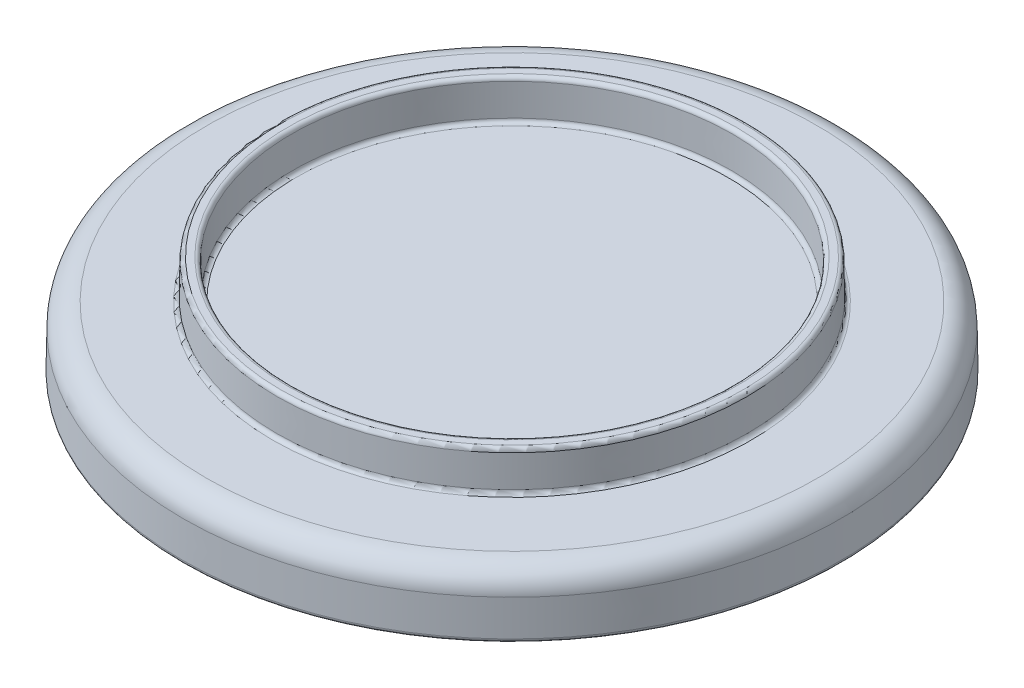
ISO-10303-21;
HEADER;
FILE_DESCRIPTION(('STEP AP214'),'2;1');
FILE_NAME('part.step','',(''),(''),'','','');
FILE_SCHEMA(('AUTOMOTIVE_DESIGN { 1 0 10303 214 1 1 1 1 }'));
ENDSEC;
DATA;
#1=APPLICATION_CONTEXT('core data for automotive mechanical design processes');
#2=APPLICATION_PROTOCOL_DEFINITION('international standard','automotive_design',2000,#1);
#3=PRODUCT_CONTEXT('',#1,'mechanical');
#4=PRODUCT('Part','Part','',(#3));
#5=PRODUCT_RELATED_PRODUCT_CATEGORY('part','',(#4));
#6=PRODUCT_DEFINITION_FORMATION('','',#4);
#7=PRODUCT_DEFINITION_CONTEXT('part definition',#1,'design');
#8=PRODUCT_DEFINITION('design','',#6,#7);
#9=PRODUCT_DEFINITION_SHAPE('','',#8);
#10=(LENGTH_UNIT() NAMED_UNIT(*) SI_UNIT(.MILLI.,.METRE.));
#11=(NAMED_UNIT(*) PLANE_ANGLE_UNIT() SI_UNIT($,.RADIAN.));
#12=(NAMED_UNIT(*) SI_UNIT($,.STERADIAN.) SOLID_ANGLE_UNIT());
#13=UNCERTAINTY_MEASURE_WITH_UNIT(LENGTH_MEASURE(1.E-05),#10,'distance_accuracy_value','');
#14=(GEOMETRIC_REPRESENTATION_CONTEXT(3) GLOBAL_UNCERTAINTY_ASSIGNED_CONTEXT((#13)) GLOBAL_UNIT_ASSIGNED_CONTEXT((#10,
#11,#12)) REPRESENTATION_CONTEXT('',''));
#15=CARTESIAN_POINT('',(0.,0.,0.));
#16=DIRECTION('',(0.,0.,1.));
#17=DIRECTION('',(1.,0.,0.));
#18=AXIS2_PLACEMENT_3D('',#15,#16,#17);
#19=CARTESIAN_POINT('',(0.,8.,0.));
#20=DIRECTION('',(0.,1.,0.));
#21=DIRECTION('',(0.,0.,1.));
#22=AXIS2_PLACEMENT_3D('',#19,#20,#21);
#23=PLANE('',#22);
#24=CARTESIAN_POINT('',(0.,8.,0.));
#25=DIRECTION('',(0.,1.,0.));
#26=DIRECTION('',(0.,0.,1.));
#27=AXIS2_PLACEMENT_3D('',#24,#25,#26);
#28=CIRCLE('',#27,30.4913486315578);
#29=CARTESIAN_POINT('',(0.,8.,30.4913486315578));
#30=VERTEX_POINT('',#29);
#31=EDGE_CURVE('E10',#30,#30,#28,.F.);
#32=ORIENTED_EDGE('',*,*,#31,.T.);
#33=EDGE_LOOP('',(#32));
#34=FACE_BOUND('',#33,.T.);
#35=CARTESIAN_POINT('',(0.,8.,0.));
#36=DIRECTION('',(0.,1.,0.));
#37=DIRECTION('',(0.,0.,1.));
#38=AXIS2_PLACEMENT_3D('',#35,#36,#37);
#39=CIRCLE('',#38,38.912572347315);
#40=CARTESIAN_POINT('',(0.,8.,38.912572347315));
#41=VERTEX_POINT('',#40);
#42=EDGE_CURVE('E58',#41,#41,#39,.T.);
#43=ORIENTED_EDGE('',*,*,#42,.T.);
#44=EDGE_LOOP('',(#43));
#45=FACE_BOUND('',#44,.T.);
#46=ADVANCED_FACE('F35',(#34,#45),#23,.T.);
#47=CARTESIAN_POINT('',(0.,0.0349048128745671,0.));
#48=DIRECTION('',(0.,-1.,0.));
#49=DIRECTION('',(0.,0.,1.));
#50=AXIS2_PLACEMENT_3D('',#47,#48,#49);
#51=CONICAL_SURFACE('',#50,41.9996953903128,0.0174532925199433);
#52=CARTESIAN_POINT('',(0.,5.05235721931185,0.));
#53=DIRECTION('',(0.,-1.,0.));
#54=DIRECTION('',(0.,0.,-1.));
#55=AXIS2_PLACEMENT_3D('',#52,#53,#54);
#56=CIRCLE('',#55,41.9121154327842);
#57=CARTESIAN_POINT('',(0.,5.05235721931185,-41.9121154327842));
#58=VERTEX_POINT('',#57);
#59=EDGE_CURVE('E55',#58,#58,#56,.T.);
#60=ORIENTED_EDGE('',*,*,#59,.T.);
#61=EDGE_LOOP('',(#60));
#62=FACE_BOUND('',#61,.T.);
#63=CARTESIAN_POINT('',(0.,0.508726203218401,0.));
#64=DIRECTION('',(0.,1.,0.));
#65=DIRECTION('',(0.,0.,1.));
#66=AXIS2_PLACEMENT_3D('',#63,#64,#65);
#67=CIRCLE('',#66,41.99142480718);
#68=CARTESIAN_POINT('',(0.,0.508726203218401,41.99142480718));
#69=VERTEX_POINT('',#68);
#70=EDGE_CURVE('E79',#69,#69,#67,.T.);
#71=ORIENTED_EDGE('',*,*,#70,.T.);
#72=EDGE_LOOP('',(#71));
#73=FACE_BOUND('',#72,.T.);
#74=ADVANCED_FACE('F102',(#62,#73),#51,.T.);
#75=CARTESIAN_POINT('',(0.,0.,0.));
#76=DIRECTION('',(0.,1.,0.));
#77=DIRECTION('',(0.,0.,1.));
#78=AXIS2_PLACEMENT_3D('',#75,#76,#77);
#79=PLANE('',#78);
#80=CARTESIAN_POINT('',(0.,0.,0.));
#81=DIRECTION('',(0.,1.,0.));
#82=DIRECTION('',(0.,0.,1.));
#83=AXIS2_PLACEMENT_3D('',#80,#81,#82);
#84=CIRCLE('',#83,40.4913486315578);
#85=CARTESIAN_POINT('',(0.,0.,40.4913486315578));
#86=VERTEX_POINT('',#85);
#87=EDGE_CURVE('E85',#86,#86,#84,.T.);
#88=ORIENTED_EDGE('',*,*,#87,.T.);
#89=EDGE_LOOP('',(#88));
#90=FACE_BOUND('',#89,.T.);
#91=CARTESIAN_POINT('',(0.,0.,0.));
#92=DIRECTION('',(0.,1.,0.));
#93=DIRECTION('',(0.,0.,1.));
#94=AXIS2_PLACEMENT_3D('',#91,#92,#93);
#95=CIRCLE('',#94,41.4915009596018);
#96=CARTESIAN_POINT('',(0.,0.,41.4915009596018));
#97=VERTEX_POINT('',#96);
#98=EDGE_CURVE('E88',#97,#97,#95,.F.);
#99=ORIENTED_EDGE('',*,*,#98,.T.);
#100=EDGE_LOOP('',(#99));
#101=FACE_BOUND('',#100,.T.);
#102=ADVANCED_FACE('F92',(#90,#101),#79,.F.);
#103=CARTESIAN_POINT('',(0.,0.,0.));
#104=DIRECTION('',(0.,-1.,0.));
#105=DIRECTION('',(0.,0.,1.));
#106=AXIS2_PLACEMENT_3D('',#103,#104,#105);
#107=CONICAL_SURFACE('',#106,40.,0.0174532925199433);
#108=CARTESIAN_POINT('',(0.,5.01745240643725,0.));
#109=DIRECTION('',(0.,1.,0.));
#110=DIRECTION('',(0.,0.,1.));
#111=AXIS2_PLACEMENT_3D('',#108,#109,#110);
#112=CIRCLE('',#111,39.9124200424714);
#113=CARTESIAN_POINT('',(0.,5.01745240643725,39.9124200424714));
#114=VERTEX_POINT('',#113);
#115=EDGE_CURVE('E64',#114,#114,#112,.T.);
#116=ORIENTED_EDGE('',*,*,#115,.T.);
#117=EDGE_LOOP('',(#116));
#118=FACE_BOUND('',#117,.T.);
#119=CARTESIAN_POINT('',(0.,0.491273796781358,0.));
#120=DIRECTION('',(0.,-1.,0.));
#121=DIRECTION('',(0.,0.,-1.));
#122=AXIS2_PLACEMENT_3D('',#119,#120,#121);
#123=CIRCLE('',#122,39.9914247839797);
#124=CARTESIAN_POINT('',(0.,0.491273796781358,-39.9914247839797));
#125=VERTEX_POINT('',#124);
#126=EDGE_CURVE('E82',#125,#125,#123,.T.);
#127=ORIENTED_EDGE('',*,*,#126,.T.);
#128=EDGE_LOOP('',(#127));
#129=FACE_BOUND('',#128,.T.);
#130=ADVANCED_FACE('F111',(#118,#129),#107,.F.);
#131=CARTESIAN_POINT('',(0.,6.,0.));
#132=DIRECTION('',(0.,1.,0.));
#133=DIRECTION('',(0.,0.,1.));
#134=AXIS2_PLACEMENT_3D('',#131,#132,#133);
#135=PLANE('',#134);
#136=CARTESIAN_POINT('',(0.,6.,0.));
#137=DIRECTION('',(0.,1.,0.));
#138=DIRECTION('',(0.,0.,1.));
#139=AXIS2_PLACEMENT_3D('',#136,#137,#138);
#140=CIRCLE('',#139,38.912572347315);
#141=CARTESIAN_POINT('',(0.,6.,38.912572347315));
#142=VERTEX_POINT('',#141);
#143=EDGE_CURVE('E61',#142,#142,#140,.F.);
#144=ORIENTED_EDGE('',*,*,#143,.T.);
#145=EDGE_LOOP('',(#144));
#146=FACE_BOUND('',#145,.T.);
#147=ADVANCED_FACE('F161',(#146),#135,.F.);
#148=CARTESIAN_POINT('',(0.,13.,0.));
#149=DIRECTION('',(0.,1.,0.));
#150=DIRECTION('',(0.,0.,1.));
#151=AXIS2_PLACEMENT_3D('',#148,#149,#150);
#152=PLANE('',#151);
#153=CARTESIAN_POINT('',(0.,13.,0.));
#154=DIRECTION('',(0.,1.,0.));
#155=DIRECTION('',(0.,0.,1.));
#156=AXIS2_PLACEMENT_3D('',#153,#154,#155);
#157=CIRCLE('',#156,28.5786239561989);
#158=CARTESIAN_POINT('',(0.,13.,28.5786239561989));
#159=VERTEX_POINT('',#158);
#160=EDGE_CURVE('E70',#159,#159,#157,.F.);
#161=ORIENTED_EDGE('',*,*,#160,.T.);
#162=EDGE_LOOP('',(#161));
#163=FACE_BOUND('',#162,.T.);
#164=CARTESIAN_POINT('',(0.,13.,0.));
#165=DIRECTION('',(0.,1.,0.));
#166=DIRECTION('',(0.,0.,1.));
#167=AXIS2_PLACEMENT_3D('',#164,#165,#166);
#168=CIRCLE('',#167,29.4213760438011);
#169=CARTESIAN_POINT('',(0.,13.,29.4213760438011));
#170=VERTEX_POINT('',#169);
#171=EDGE_CURVE('E73',#170,#170,#168,.T.);
#172=ORIENTED_EDGE('',*,*,#171,.T.);
#173=EDGE_LOOP('',(#172));
#174=FACE_BOUND('',#173,.T.);
#175=ADVANCED_FACE('F157',(#163,#174),#152,.T.);
#176=CARTESIAN_POINT('',(0.,8.,0.));
#177=DIRECTION('',(0.,-1.,0.));
#178=DIRECTION('',(0.,0.,1.));
#179=AXIS2_PLACEMENT_3D('',#176,#177,#178);
#180=CONICAL_SURFACE('',#179,30.,0.0174532925199433);
#181=CARTESIAN_POINT('',(0.,8.49127379678127,0.));
#182=DIRECTION('',(0.,1.,0.));
#183=DIRECTION('',(0.,0.,1.));
#184=AXIS2_PLACEMENT_3D('',#181,#182,#183);
#185=CIRCLE('',#184,29.9914247839796);
#186=CARTESIAN_POINT('',(0.,8.49127379678127,29.9914247839796));
#187=VERTEX_POINT('',#186);
#188=EDGE_CURVE('E42',#187,#187,#185,.T.);
#189=ORIENTED_EDGE('',*,*,#188,.T.);
#190=EDGE_LOOP('',(#189));
#191=FACE_BOUND('',#190,.T.);
#192=CARTESIAN_POINT('',(0.,12.5087262032186,0.));
#193=DIRECTION('',(0.,-1.,0.));
#194=DIRECTION('',(0.,0.,-1.));
#195=AXIS2_PLACEMENT_3D('',#192,#193,#194);
#196=CIRCLE('',#195,29.9212998913793);
#197=CARTESIAN_POINT('',(0.,12.5087262032186,-29.9212998913793));
#198=VERTEX_POINT('',#197);
#199=EDGE_CURVE('E67',#198,#198,#196,.T.);
#200=ORIENTED_EDGE('',*,*,#199,.T.);
#201=EDGE_LOOP('',(#200));
#202=FACE_BOUND('',#201,.T.);
#203=ADVANCED_FACE('F150',(#191,#202),#180,.T.);
#204=CARTESIAN_POINT('',(0.,8.,0.));
#205=DIRECTION('',(0.,1.,0.));
#206=DIRECTION('',(0.,0.,1.));
#207=AXIS2_PLACEMENT_3D('',#204,#205,#206);
#208=CONICAL_SURFACE('',#207,28.,0.0174532925199433);
#209=CARTESIAN_POINT('',(0.,8.49127379678136,0.));
#210=DIRECTION('',(0.,1.,0.));
#211=DIRECTION('',(0.,0.,1.));
#212=AXIS2_PLACEMENT_3D('',#209,#210,#211);
#213=CIRCLE('',#212,28.0085752160203);
#214=CARTESIAN_POINT('',(0.,8.49127379678136,28.0085752160203));
#215=VERTEX_POINT('',#214);
#216=EDGE_CURVE('E50',#215,#215,#213,.F.);
#217=ORIENTED_EDGE('',*,*,#216,.T.);
#218=EDGE_LOOP('',(#217));
#219=FACE_BOUND('',#218,.T.);
#220=CARTESIAN_POINT('',(0.,12.5087262032186,0.));
#221=DIRECTION('',(0.,-1.,0.));
#222=DIRECTION('',(0.,0.,-1.));
#223=AXIS2_PLACEMENT_3D('',#220,#221,#222);
#224=CIRCLE('',#223,28.0787001086207);
#225=CARTESIAN_POINT('',(0.,12.5087262032186,-28.0787001086207));
#226=VERTEX_POINT('',#225);
#227=EDGE_CURVE('E76',#226,#226,#224,.F.);
#228=ORIENTED_EDGE('',*,*,#227,.T.);
#229=EDGE_LOOP('',(#228));
#230=FACE_BOUND('',#229,.T.);
#231=ADVANCED_FACE('F120',(#219,#230),#208,.F.);
#232=CARTESIAN_POINT('',(0.,8.,0.));
#233=DIRECTION('',(0.,1.,0.));
#234=DIRECTION('',(0.,0.,1.));
#235=AXIS2_PLACEMENT_3D('',#232,#233,#234);
#236=CIRCLE('',#235,27.5086513684422);
#237=CARTESIAN_POINT('',(0.,8.,27.5086513684422));
#238=VERTEX_POINT('',#237);
#239=EDGE_CURVE('E46',#238,#238,#236,.T.);
#240=ORIENTED_EDGE('',*,*,#239,.T.);
#241=EDGE_LOOP('',(#240));
#242=FACE_BOUND('',#241,.T.);
#243=ADVANCED_FACE('F116',(#242),#23,.T.);
#244=CARTESIAN_POINT('',(0.,0.5,0.));
#245=DIRECTION('',(0.,1.,0.));
#246=DIRECTION('',(0.,0.,1.));
#247=AXIS2_PLACEMENT_3D('',#244,#245,#246);
#248=TOROIDAL_SURFACE('',#247,40.4913486315578,0.5);
#249=ORIENTED_EDGE('',*,*,#126,.F.);
#250=EDGE_LOOP('',(#249));
#251=FACE_BOUND('',#250,.T.);
#252=ORIENTED_EDGE('',*,*,#87,.F.);
#253=EDGE_LOOP('',(#252));
#254=FACE_BOUND('',#253,.T.);
#255=ADVANCED_FACE('F98',(#251,#254),#248,.T.);
#256=CARTESIAN_POINT('',(0.,0.5,0.));
#257=DIRECTION('',(0.,1.,0.));
#258=DIRECTION('',(0.,0.,1.));
#259=AXIS2_PLACEMENT_3D('',#256,#257,#258);
#260=TOROIDAL_SURFACE('',#259,41.4915009596018,0.5);
#261=ORIENTED_EDGE('',*,*,#98,.F.);
#262=EDGE_LOOP('',(#261));
#263=FACE_BOUND('',#262,.T.);
#264=ORIENTED_EDGE('',*,*,#70,.F.);
#265=EDGE_LOOP('',(#264));
#266=FACE_BOUND('',#265,.T.);
#267=ADVANCED_FACE('F94',(#263,#266),#260,.T.);
#268=CARTESIAN_POINT('',(0.,12.5,0.));
#269=DIRECTION('',(0.,1.,0.));
#270=DIRECTION('',(0.,0.,1.));
#271=AXIS2_PLACEMENT_3D('',#268,#269,#270);
#272=TOROIDAL_SURFACE('',#271,28.5786239561989,0.5);
#273=ORIENTED_EDGE('',*,*,#160,.F.);
#274=EDGE_LOOP('',(#273));
#275=FACE_BOUND('',#274,.T.);
#276=ORIENTED_EDGE('',*,*,#227,.F.);
#277=EDGE_LOOP('',(#276));
#278=FACE_BOUND('',#277,.T.);
#279=ADVANCED_FACE('F97',(#275,#278),#272,.T.);
#280=CARTESIAN_POINT('',(0.,12.5,0.));
#281=DIRECTION('',(0.,1.,0.));
#282=DIRECTION('',(0.,0.,1.));
#283=AXIS2_PLACEMENT_3D('',#280,#281,#282);
#284=TOROIDAL_SURFACE('',#283,29.4213760438011,0.5);
#285=ORIENTED_EDGE('',*,*,#199,.F.);
#286=EDGE_LOOP('',(#285));
#287=FACE_BOUND('',#286,.T.);
#288=ORIENTED_EDGE('',*,*,#171,.F.);
#289=EDGE_LOOP('',(#288));
#290=FACE_BOUND('',#289,.T.);
#291=ADVANCED_FACE('F127',(#287,#290),#284,.T.);
#292=CARTESIAN_POINT('',(0.,5.,0.));
#293=DIRECTION('',(0.,1.,0.));
#294=DIRECTION('',(0.,0.,1.));
#295=AXIS2_PLACEMENT_3D('',#292,#293,#294);
#296=TOROIDAL_SURFACE('',#295,38.912572347315,1.);
#297=ORIENTED_EDGE('',*,*,#143,.F.);
#298=EDGE_LOOP('',(#297));
#299=FACE_BOUND('',#298,.T.);
#300=ORIENTED_EDGE('',*,*,#115,.F.);
#301=EDGE_LOOP('',(#300));
#302=FACE_BOUND('',#301,.T.);
#303=ADVANCED_FACE('F131',(#299,#302),#296,.F.);
#304=CARTESIAN_POINT('',(0.,5.,0.));
#305=DIRECTION('',(0.,1.,0.));
#306=DIRECTION('',(0.,0.,1.));
#307=AXIS2_PLACEMENT_3D('',#304,#305,#306);
#308=TOROIDAL_SURFACE('',#307,38.912572347315,3.);
#309=ORIENTED_EDGE('',*,*,#59,.F.);
#310=EDGE_LOOP('',(#309));
#311=FACE_BOUND('',#310,.T.);
#312=ORIENTED_EDGE('',*,*,#42,.F.);
#313=EDGE_LOOP('',(#312));
#314=FACE_BOUND('',#313,.T.);
#315=ADVANCED_FACE('F134',(#311,#314),#308,.T.);
#316=CARTESIAN_POINT('',(0.,8.5,0.));
#317=DIRECTION('',(0.,1.,0.));
#318=DIRECTION('',(0.,0.,1.));
#319=AXIS2_PLACEMENT_3D('',#316,#317,#318);
#320=TOROIDAL_SURFACE('',#319,27.5086513684422,0.5);
#321=ORIENTED_EDGE('',*,*,#239,.F.);
#322=EDGE_LOOP('',(#321));
#323=FACE_BOUND('',#322,.T.);
#324=ORIENTED_EDGE('',*,*,#216,.F.);
#325=EDGE_LOOP('',(#324));
#326=FACE_BOUND('',#325,.T.);
#327=ADVANCED_FACE('F136',(#323,#326),#320,.F.);
#328=CARTESIAN_POINT('',(0.,8.5,0.));
#329=DIRECTION('',(0.,1.,0.));
#330=DIRECTION('',(0.,0.,1.));
#331=AXIS2_PLACEMENT_3D('',#328,#329,#330);
#332=TOROIDAL_SURFACE('',#331,30.4913486315578,0.5);
#333=ORIENTED_EDGE('',*,*,#31,.F.);
#334=EDGE_LOOP('',(#333));
#335=FACE_BOUND('',#334,.T.);
#336=ORIENTED_EDGE('',*,*,#188,.F.);
#337=EDGE_LOOP('',(#336));
#338=FACE_BOUND('',#337,.T.);
#339=ADVANCED_FACE('F37',(#335,#338),#332,.F.);
#340=CLOSED_SHELL('',(#46,#74,#102,#130,#147,#175,#203,#231,#243,#255,#267,#279,#291,#303,#315,
#327,#339));
#341=MANIFOLD_SOLID_BREP('B2',#340);
#342=ADVANCED_BREP_SHAPE_REPRESENTATION('',(#18,#341),#14);
#343=SHAPE_DEFINITION_REPRESENTATION(#9,#342);
ENDSEC;
END-ISO-10303-21;
